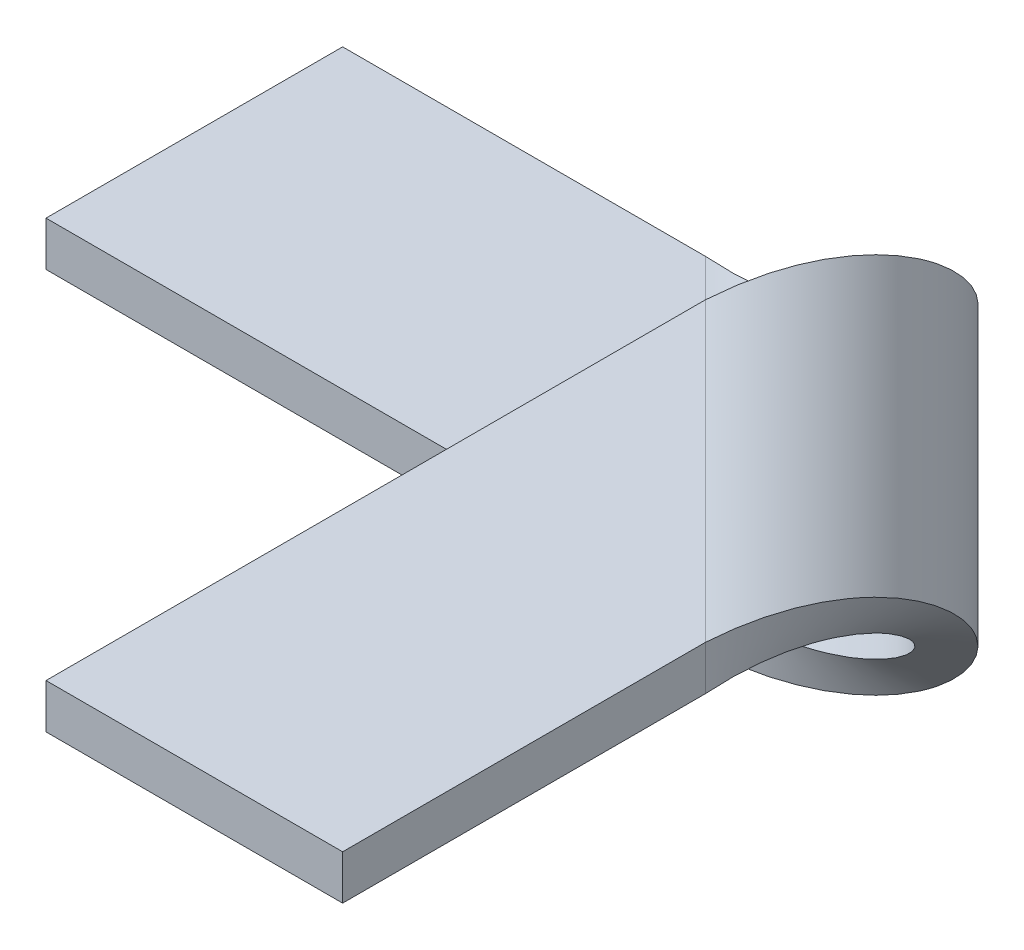
ISO-10303-21;
HEADER;
FILE_DESCRIPTION(('STEP AP214'),'2;1');
FILE_NAME('part.step','',(''),(''),'','','');
FILE_SCHEMA(('AUTOMOTIVE_DESIGN { 1 0 10303 214 1 1 1 1 }'));
ENDSEC;
DATA;
#1=APPLICATION_CONTEXT('core data for automotive mechanical design processes');
#2=APPLICATION_PROTOCOL_DEFINITION('international standard','automotive_design',2000,#1);
#3=PRODUCT_CONTEXT('',#1,'mechanical');
#4=PRODUCT('Part','Part','',(#3));
#5=PRODUCT_RELATED_PRODUCT_CATEGORY('part','',(#4));
#6=PRODUCT_DEFINITION_FORMATION('','',#4);
#7=PRODUCT_DEFINITION_CONTEXT('part definition',#1,'design');
#8=PRODUCT_DEFINITION('design','',#6,#7);
#9=PRODUCT_DEFINITION_SHAPE('','',#8);
#10=(LENGTH_UNIT() NAMED_UNIT(*) SI_UNIT(.MILLI.,.METRE.));
#11=(NAMED_UNIT(*) PLANE_ANGLE_UNIT() SI_UNIT($,.RADIAN.));
#12=(NAMED_UNIT(*) SI_UNIT($,.STERADIAN.) SOLID_ANGLE_UNIT());
#13=UNCERTAINTY_MEASURE_WITH_UNIT(LENGTH_MEASURE(1.E-05),#10,'distance_accuracy_value','');
#14=(GEOMETRIC_REPRESENTATION_CONTEXT(3) GLOBAL_UNCERTAINTY_ASSIGNED_CONTEXT((#13)) GLOBAL_UNIT_ASSIGNED_CONTEXT((#10,
#11,#12)) REPRESENTATION_CONTEXT('',''));
#15=CARTESIAN_POINT('',(0.,0.,0.));
#16=DIRECTION('',(0.,0.,1.));
#17=DIRECTION('',(1.,0.,0.));
#18=AXIS2_PLACEMENT_3D('',#15,#16,#17);
#19=CARTESIAN_POINT('',(-1.26770716227688E-13,46.0000000000003,1.12892928419874E-13));
#20=DIRECTION('',(0.,-1.,0.));
#21=DIRECTION('',(1.,0.,0.));
#22=AXIS2_PLACEMENT_3D('',#19,#20,#21);
#23=PLANE('',#22);
#24=DIRECTION('',(0.,0.,1.));
#25=VECTOR('',#24,1.);
#26=CARTESIAN_POINT('',(20.0000000000013,45.9999999999998,120.));
#27=LINE('',#26,#25);
#28=CARTESIAN_POINT('',(20.0000000000007,46.,71.0931537888217));
#29=VERTEX_POINT('',#28);
#30=CARTESIAN_POINT('',(20.0000000000013,45.9999999999998,120.));
#31=VERTEX_POINT('',#30);
#32=EDGE_CURVE('E221',#29,#31,#27,.T.);
#33=ORIENTED_EDGE('',*,*,#32,.F.);
#34=DIRECTION('',(-0.707106781186551,0.,-0.707106781186544));
#35=VECTOR('',#34,1.);
#36=CARTESIAN_POINT('',(-25.5465768944106,46.,25.5465768944109));
#37=LINE('',#36,#35);
#38=CARTESIAN_POINT('',(-19.9999999999997,46.,31.0931537888218));
#39=VERTEX_POINT('',#38);
#40=EDGE_CURVE('E154',#29,#39,#37,.T.);
#41=ORIENTED_EDGE('',*,*,#40,.T.);
#42=DIRECTION('',(0.,0.,-1.));
#43=VECTOR('',#42,1.);
#44=CARTESIAN_POINT('',(-19.9999999999987,45.9999999999996,120.));
#45=LINE('',#44,#43);
#46=CARTESIAN_POINT('',(-19.9999999999987,45.9999999999996,120.));
#47=VERTEX_POINT('',#46);
#48=EDGE_CURVE('E230',#47,#39,#45,.T.);
#49=ORIENTED_EDGE('',*,*,#48,.F.);
#50=DIRECTION('',(-1.,0.,0.));
#51=VECTOR('',#50,1.);
#52=CARTESIAN_POINT('',(20.0000000000013,45.9999999999998,120.));
#53=LINE('',#52,#51);
#54=EDGE_CURVE('E227',#31,#47,#53,.T.);
#55=ORIENTED_EDGE('',*,*,#54,.F.);
#56=EDGE_LOOP('',(#33,#41,#49,#55));
#57=FACE_BOUND('',#56,.T.);
#58=ADVANCED_FACE('F57',(#57),#23,.F.);
#59=CARTESIAN_POINT('',(-19.9999999999987,45.9999999999996,120.));
#60=DIRECTION('',(-1.,0.,0.));
#61=DIRECTION('',(0.,0.,-1.));
#62=AXIS2_PLACEMENT_3D('',#59,#60,#61);
#63=PLANE('',#62);
#64=CARTESIAN_POINT('',(-19.9999999999996,40.,31.0931537888218));
#65=CARTESIAN_POINT('',(-19.9999999999997,46.,31.0931537888218));
#66=B_SPLINE_CURVE_WITH_KNOTS('',1,(#64,#65),.UNSPECIFIED.,.F.,.F.,(2,2),(0.,1.),.UNSPECIFIED.);
#67=CARTESIAN_POINT('',(-19.9999999999997,40.,31.0931537888217));
#68=VERTEX_POINT('',#67);
#69=EDGE_CURVE('E12',#68,#39,#66,.T.);
#70=ORIENTED_EDGE('',*,*,#69,.F.);
#71=DIRECTION('',(0.,0.,-1.));
#72=VECTOR('',#71,1.);
#73=CARTESIAN_POINT('',(-19.9999999999987,39.9999999999996,120.));
#74=LINE('',#73,#72);
#75=CARTESIAN_POINT('',(-19.9999999999987,39.9999999999996,120.));
#76=VERTEX_POINT('',#75);
#77=EDGE_CURVE('E74',#76,#68,#74,.T.);
#78=ORIENTED_EDGE('',*,*,#77,.F.);
#79=DIRECTION('',(0.,-1.,0.));
#80=VECTOR('',#79,1.);
#81=CARTESIAN_POINT('',(-19.9999999999987,45.9999999999996,120.));
#82=LINE('',#81,#80);
#83=EDGE_CURVE('E490',#47,#76,#82,.T.);
#84=ORIENTED_EDGE('',*,*,#83,.F.);
#85=ORIENTED_EDGE('',*,*,#48,.T.);
#86=EDGE_LOOP('',(#70,#78,#84,#85));
#87=FACE_BOUND('',#86,.T.);
#88=ADVANCED_FACE('F59',(#87),#63,.T.);
#89=CARTESIAN_POINT('',(20.0000000000013,45.9999999999998,120.));
#90=DIRECTION('',(0.,0.,1.));
#91=DIRECTION('',(-1.,0.,0.));
#92=AXIS2_PLACEMENT_3D('',#89,#90,#91);
#93=PLANE('',#92);
#94=DIRECTION('',(-1.,0.,0.));
#95=VECTOR('',#94,1.);
#96=CARTESIAN_POINT('',(20.0000000000013,39.9999999999998,120.));
#97=LINE('',#96,#95);
#98=CARTESIAN_POINT('',(20.0000000000013,39.9999999999998,120.));
#99=VERTEX_POINT('',#98);
#100=EDGE_CURVE('E232',#99,#76,#97,.T.);
#101=ORIENTED_EDGE('',*,*,#100,.F.);
#102=DIRECTION('',(0.,-1.,0.));
#103=VECTOR('',#102,1.);
#104=CARTESIAN_POINT('',(20.0000000000013,45.9999999999998,120.));
#105=LINE('',#104,#103);
#106=EDGE_CURVE('E494',#31,#99,#105,.T.);
#107=ORIENTED_EDGE('',*,*,#106,.F.);
#108=ORIENTED_EDGE('',*,*,#54,.T.);
#109=ORIENTED_EDGE('',*,*,#83,.T.);
#110=EDGE_LOOP('',(#101,#107,#108,#109));
#111=FACE_BOUND('',#110,.T.);
#112=ADVANCED_FACE('F205',(#111),#93,.T.);
#113=CARTESIAN_POINT('',(20.0000000000013,45.9999999999998,120.));
#114=DIRECTION('',(1.,0.,0.));
#115=DIRECTION('',(0.,0.,1.));
#116=AXIS2_PLACEMENT_3D('',#113,#114,#115);
#117=PLANE('',#116);
#118=CARTESIAN_POINT('',(20.0000000000008,46.,71.0931537888218));
#119=CARTESIAN_POINT('',(20.0000000000009,40.,71.0931537888218));
#120=B_SPLINE_CURVE_WITH_KNOTS('',1,(#118,#119),.UNSPECIFIED.,.F.,.F.,(2,2),(0.,1.),.UNSPECIFIED.);
#121=CARTESIAN_POINT('',(20.0000000000007,40.,71.0931537888217));
#122=VERTEX_POINT('',#121);
#123=EDGE_CURVE('E314',#29,#122,#120,.T.);
#124=ORIENTED_EDGE('',*,*,#123,.F.);
#125=ORIENTED_EDGE('',*,*,#32,.T.);
#126=ORIENTED_EDGE('',*,*,#106,.T.);
#127=DIRECTION('',(0.,0.,1.));
#128=VECTOR('',#127,1.);
#129=CARTESIAN_POINT('',(20.0000000000013,39.9999999999998,120.));
#130=LINE('',#129,#128);
#131=EDGE_CURVE('E82',#122,#99,#130,.T.);
#132=ORIENTED_EDGE('',*,*,#131,.F.);
#133=EDGE_LOOP('',(#124,#125,#126,#132));
#134=FACE_BOUND('',#133,.T.);
#135=ADVANCED_FACE('F208',(#134),#117,.T.);
#136=CARTESIAN_POINT('',(0.,40.0000000000003,0.));
#137=DIRECTION('',(0.,-1.,0.));
#138=DIRECTION('',(1.,0.,0.));
#139=AXIS2_PLACEMENT_3D('',#136,#137,#138);
#140=PLANE('',#139);
#141=DIRECTION('',(-0.707106781186551,0.,-0.707106781186544));
#142=VECTOR('',#141,1.);
#143=CARTESIAN_POINT('',(-25.5465768944106,40.,25.5465768944109));
#144=LINE('',#143,#142);
#145=EDGE_CURVE('E67',#122,#68,#144,.T.);
#146=ORIENTED_EDGE('',*,*,#145,.F.);
#147=ORIENTED_EDGE('',*,*,#131,.T.);
#148=ORIENTED_EDGE('',*,*,#100,.T.);
#149=ORIENTED_EDGE('',*,*,#77,.T.);
#150=EDGE_LOOP('',(#146,#147,#148,#149));
#151=FACE_BOUND('',#150,.T.);
#152=ADVANCED_FACE('F215',(#151),#140,.T.);
#153=CARTESIAN_POINT('',(-120.,-6.,20.));
#154=DIRECTION('',(-1.,0.,0.));
#155=DIRECTION('',(0.,0.,1.));
#156=AXIS2_PLACEMENT_3D('',#153,#154,#155);
#157=PLANE('',#156);
#158=DIRECTION('',(0.,0.,1.));
#159=VECTOR('',#158,1.);
#160=CARTESIAN_POINT('',(-120.,0.,20.));
#161=LINE('',#160,#159);
#162=CARTESIAN_POINT('',(-120.,0.,-20.));
#163=VERTEX_POINT('',#162);
#164=CARTESIAN_POINT('',(-120.,0.,20.));
#165=VERTEX_POINT('',#164);
#166=EDGE_CURVE('E252',#163,#165,#161,.T.);
#167=ORIENTED_EDGE('',*,*,#166,.F.);
#168=DIRECTION('',(0.,1.,0.));
#169=VECTOR('',#168,1.);
#170=CARTESIAN_POINT('',(-120.,-6.,-20.));
#171=LINE('',#170,#169);
#172=CARTESIAN_POINT('',(-120.,-6.,-20.));
#173=VERTEX_POINT('',#172);
#174=EDGE_CURVE('E180',#173,#163,#171,.T.);
#175=ORIENTED_EDGE('',*,*,#174,.F.);
#176=DIRECTION('',(0.,0.,1.));
#177=VECTOR('',#176,1.);
#178=CARTESIAN_POINT('',(-120.,-6.,20.));
#179=LINE('',#178,#177);
#180=CARTESIAN_POINT('',(-120.,-6.,20.));
#181=VERTEX_POINT('',#180);
#182=EDGE_CURVE('E168',#173,#181,#179,.T.);
#183=ORIENTED_EDGE('',*,*,#182,.T.);
#184=DIRECTION('',(0.,1.,0.));
#185=VECTOR('',#184,1.);
#186=CARTESIAN_POINT('',(-120.,-6.,20.));
#187=LINE('',#186,#185);
#188=EDGE_CURVE('E171',#181,#165,#187,.T.);
#189=ORIENTED_EDGE('',*,*,#188,.T.);
#190=EDGE_LOOP('',(#167,#175,#183,#189));
#191=FACE_BOUND('',#190,.T.);
#192=ADVANCED_FACE('F277',(#191),#157,.T.);
#193=CARTESIAN_POINT('',(0.,-6.,0.));
#194=DIRECTION('',(0.,1.,0.));
#195=DIRECTION('',(0.,0.,1.));
#196=AXIS2_PLACEMENT_3D('',#193,#194,#195);
#197=PLANE('',#196);
#198=DIRECTION('',(-0.707106781186552,0.,-0.707106781186543));
#199=VECTOR('',#198,1.);
#200=CARTESIAN_POINT('',(-25.5465768944105,-6.,25.5465768944108));
#201=LINE('',#200,#199);
#202=CARTESIAN_POINT('',(-31.0931537888213,-6.00000000000001,20.0000000000001));
#203=VERTEX_POINT('',#202);
#204=CARTESIAN_POINT('',(-71.0931537888218,-6.,-20.));
#205=VERTEX_POINT('',#204);
#206=EDGE_CURVE('E151',#203,#205,#201,.T.);
#207=ORIENTED_EDGE('',*,*,#206,.F.);
#208=DIRECTION('',(1.,0.,0.));
#209=VECTOR('',#208,1.);
#210=CARTESIAN_POINT('',(120.,-6.,20.));
#211=LINE('',#210,#209);
#212=EDGE_CURVE('E143',#181,#203,#211,.T.);
#213=ORIENTED_EDGE('',*,*,#212,.F.);
#214=ORIENTED_EDGE('',*,*,#182,.F.);
#215=DIRECTION('',(-1.,0.,0.));
#216=VECTOR('',#215,1.);
#217=CARTESIAN_POINT('',(120.,-6.,-20.));
#218=LINE('',#217,#216);
#219=EDGE_CURVE('E166',#205,#173,#218,.T.);
#220=ORIENTED_EDGE('',*,*,#219,.F.);
#221=EDGE_LOOP('',(#207,#213,#214,#220));
#222=FACE_BOUND('',#221,.T.);
#223=ADVANCED_FACE('F163',(#222),#197,.F.);
#224=CARTESIAN_POINT('',(120.,-6.,20.));
#225=DIRECTION('',(0.,0.,1.));
#226=DIRECTION('',(1.,0.,0.));
#227=AXIS2_PLACEMENT_3D('',#224,#225,#226);
#228=PLANE('',#227);
#229=ORIENTED_EDGE('',*,*,#212,.T.);
#230=CARTESIAN_POINT('',(-31.0931537888213,0.,20.0000000000001));
#231=CARTESIAN_POINT('',(-31.0931537888213,-6.00000000000001,20.0000000000001));
#232=B_SPLINE_CURVE_WITH_KNOTS('',1,(#230,#231),.UNSPECIFIED.,.F.,.F.,(2,2),(0.,1.),.UNSPECIFIED.);
#233=CARTESIAN_POINT('',(-31.0931537888214,0.,20.));
#234=VERTEX_POINT('',#233);
#235=EDGE_CURVE('E126',#203,#234,#232,.F.);
#236=ORIENTED_EDGE('',*,*,#235,.T.);
#237=DIRECTION('',(1.,0.,0.));
#238=VECTOR('',#237,1.);
#239=CARTESIAN_POINT('',(120.,0.,20.));
#240=LINE('',#239,#238);
#241=EDGE_CURVE('E142',#165,#234,#240,.T.);
#242=ORIENTED_EDGE('',*,*,#241,.F.);
#243=ORIENTED_EDGE('',*,*,#188,.F.);
#244=EDGE_LOOP('',(#229,#236,#242,#243));
#245=FACE_BOUND('',#244,.T.);
#246=ADVANCED_FACE('F170',(#245),#228,.T.);
#247=CARTESIAN_POINT('',(0.,0.,0.));
#248=DIRECTION('',(0.,1.,0.));
#249=DIRECTION('',(0.,0.,1.));
#250=AXIS2_PLACEMENT_3D('',#247,#248,#249);
#251=PLANE('',#250);
#252=ORIENTED_EDGE('',*,*,#241,.T.);
#253=DIRECTION('',(-0.707106781186552,0.,-0.707106781186543));
#254=VECTOR('',#253,1.);
#255=CARTESIAN_POINT('',(-25.5465768944105,0.,25.5465768944108));
#256=LINE('',#255,#254);
#257=CARTESIAN_POINT('',(-71.0931537888218,0.,-19.9999999999999));
#258=VERTEX_POINT('',#257);
#259=EDGE_CURVE('E256',#234,#258,#256,.T.);
#260=ORIENTED_EDGE('',*,*,#259,.T.);
#261=DIRECTION('',(-1.,0.,0.));
#262=VECTOR('',#261,1.);
#263=CARTESIAN_POINT('',(120.,0.,-20.));
#264=LINE('',#263,#262);
#265=EDGE_CURVE('E191',#258,#163,#264,.T.);
#266=ORIENTED_EDGE('',*,*,#265,.T.);
#267=ORIENTED_EDGE('',*,*,#166,.T.);
#268=EDGE_LOOP('',(#252,#260,#266,#267));
#269=FACE_BOUND('',#268,.T.);
#270=ADVANCED_FACE('F203',(#269),#251,.T.);
#271=CARTESIAN_POINT('',(120.,-6.,-20.));
#272=DIRECTION('',(0.,0.,-1.));
#273=DIRECTION('',(-1.,0.,0.));
#274=AXIS2_PLACEMENT_3D('',#271,#272,#273);
#275=PLANE('',#274);
#276=ORIENTED_EDGE('',*,*,#265,.F.);
#277=CARTESIAN_POINT('',(-71.0931537888218,-6.00000000000001,-19.9999999999999));
#278=CARTESIAN_POINT('',(-71.0931537888218,0.,-19.9999999999999));
#279=B_SPLINE_CURVE_WITH_KNOTS('',1,(#277,#278),.UNSPECIFIED.,.F.,.F.,(2,2),(0.,1.),.UNSPECIFIED.);
#280=EDGE_CURVE('E181',#258,#205,#279,.F.);
#281=ORIENTED_EDGE('',*,*,#280,.T.);
#282=ORIENTED_EDGE('',*,*,#219,.T.);
#283=ORIENTED_EDGE('',*,*,#174,.T.);
#284=EDGE_LOOP('',(#276,#281,#282,#283));
#285=FACE_BOUND('',#284,.T.);
#286=ADVANCED_FACE('F193',(#285),#275,.T.);
#287=CARTESIAN_POINT('',(20.0000000000008,46.,71.0931537888218));
#288=CARTESIAN_POINT('',(20.2777082698823,46.,66.557252047424));
#289=CARTESIAN_POINT('',(20.5544134880493,45.3232895933763,62.023214669303));
#290=CARTESIAN_POINT('',(20.7433966685479,42.7184460972108,53.318705857334));
#291=CARTESIAN_POINT('',(20.6538969399684,40.7913379023528,49.1504427701784));
#292=CARTESIAN_POINT('',(19.7995261656221,35.9782147193479,41.4892879130543));
#293=CARTESIAN_POINT('',(19.0333160304188,33.0940934896435,37.9977352325224));
#294=CARTESIAN_POINT('',(16.6174557147519,26.8054449933414,31.8980699167189));
#295=CARTESIAN_POINT('',(14.9670808243075,23.403392041389,29.2906819914282));
#296=CARTESIAN_POINT('',(10.7093180085724,16.5966079586111,25.032919175693));
#297=CARTESIAN_POINT('',(8.1019300832816,13.1945550066588,23.3825442852486));
#298=CARTESIAN_POINT('',(2.00226476747813,6.90590651035668,20.9666839695818));
#299=CARTESIAN_POINT('',(-1.48928791305372,4.02178528065227,20.2004738343785));
#300=CARTESIAN_POINT('',(-9.15044277017782,-0.791337902352648,19.3461030600324));
#301=CARTESIAN_POINT('',(-13.3187058573335,-2.71844609721068,19.2566033314528));
#302=CARTESIAN_POINT('',(-22.0232146693025,-5.3232895933762,19.4455865119515));
#303=CARTESIAN_POINT('',(-26.5572520474235,-6.,19.7222917301186));
#304=CARTESIAN_POINT('',(-31.0931537888213,-6.00000000000001,20.0000000000001));
#305=CARTESIAN_POINT('',(20.0000000000009,40.,71.0931537888218));
#306=CARTESIAN_POINT('',(19.7222982598617,40.,67.1127621801614));
#307=CARTESIAN_POINT('',(19.4439112640993,39.4794535333663,63.1337168932531));
#308=CARTESIAN_POINT('',(18.6067222916208,37.4757277670852,55.4553802342611));
#309=CARTESIAN_POINT('',(18.0465960216672,35.9933368479637,51.7577436884797));
#310=CARTESIAN_POINT('',(16.4068270839235,32.2909343994984,44.881986994753));
#311=CARTESIAN_POINT('',(15.3261543473361,30.0723796074181,41.7048969156052));
#312=CARTESIAN_POINT('',(12.4852396085765,25.2349576871857,36.0302860228944));
#313=CARTESIAN_POINT('',(10.7244401371883,22.6179938779916,33.5333226785475));
#314=CARTESIAN_POINT('',(6.46667732145312,17.3820061220086,29.2755598628123));
#315=CARTESIAN_POINT('',(3.96971397710616,14.7650423128145,27.5147603914242));
#316=CARTESIAN_POINT('',(-1.70489691560463,9.92762039258205,24.6738456526646));
#317=CARTESIAN_POINT('',(-4.88198699475242,7.70906560050175,23.5931729160773));
#318=CARTESIAN_POINT('',(-11.7577436884791,4.00666315203642,21.9534039783337));
#319=CARTESIAN_POINT('',(-15.4553802342606,2.52427223291486,21.39327770838));
#320=CARTESIAN_POINT('',(-23.1337168932525,0.520546466633689,20.5560887359016));
#321=CARTESIAN_POINT('',(-27.1127621801609,0.,20.2777017401392));
#322=CARTESIAN_POINT('',(-31.0931537888213,0.,20.0000000000001));
#323=B_SPLINE_SURFACE_WITH_KNOTS('',1,3,((#287,#288,#289,#290,#291,#292,#293,#294,#295,#296,
#297,#298,#299,#300,#301,#302,#303,#304),(#305,#306,#307,#308,#309,#310,#311,#312,#313,#314,
#315,#316,#317,#318,#319,#320,#321,#322)),.UNSPECIFIED.,.F.,.F.,.F.,(2,2),(4,2,2,2,2,2,2,2,4),
(0.,1.),(0.,0.125,0.25,0.375,0.5,0.625,0.75,0.875,1.),.UNSPECIFIED.);
#324=CARTESIAN_POINT('',(20.0000000000009,40.,71.0931537888218));
#325=CARTESIAN_POINT('',(19.7222982598617,40.,67.1127621801614));
#326=CARTESIAN_POINT('',(19.4439112640993,39.4794535333663,63.1337168932531));
#327=CARTESIAN_POINT('',(18.6067222916208,37.4757277670852,55.4553802342611));
#328=CARTESIAN_POINT('',(18.0465960216672,35.9933368479637,51.7577436884797));
#329=CARTESIAN_POINT('',(16.4068270839235,32.2909343994984,44.881986994753));
#330=CARTESIAN_POINT('',(15.3261543473361,30.0723796074181,41.7048969156052));
#331=CARTESIAN_POINT('',(12.4852396085765,25.2349576871857,36.0302860228944));
#332=CARTESIAN_POINT('',(10.7244401371883,22.6179938779916,33.5333226785475));
#333=CARTESIAN_POINT('',(6.46667732145312,17.3820061220086,29.2755598628123));
#334=CARTESIAN_POINT('',(3.96971397710616,14.7650423128145,27.5147603914242));
#335=CARTESIAN_POINT('',(-1.70489691560463,9.92762039258205,24.6738456526646));
#336=CARTESIAN_POINT('',(-4.88198699475242,7.70906560050175,23.5931729160773));
#337=CARTESIAN_POINT('',(-11.7577436884791,4.00666315203642,21.9534039783337));
#338=CARTESIAN_POINT('',(-15.4553802342606,2.52427223291486,21.39327770838));
#339=CARTESIAN_POINT('',(-23.1337168932525,0.520546466633689,20.5560887359016));
#340=CARTESIAN_POINT('',(-27.1127621801609,0.,20.2777017401392));
#341=CARTESIAN_POINT('',(-31.0931537888213,0.,20.0000000000001));
#342=B_SPLINE_CURVE_WITH_KNOTS('',3,(#324,#325,#326,#327,#328,#329,#330,#331,#332,#333,#334,
#335,#336,#337,#338,#339,#340,#341),.UNSPECIFIED.,.F.,.F.,(4,2,2,2,2,2,2,2,4),(0.,0.125,0.25,
0.375,0.5,0.625,0.75,0.875,1.),.UNSPECIFIED.);
#343=EDGE_CURVE('E135',#122,#234,#342,.T.);
#344=CARTESIAN_POINT('',(-31.0931537888213,-6.00000000000001,20.0000000000001));
#345=CARTESIAN_POINT('',(-26.5572520474235,-6.,19.7222917301186));
#346=CARTESIAN_POINT('',(-22.0232146693025,-5.3232895933762,19.4455865119515));
#347=CARTESIAN_POINT('',(-13.3187058573335,-2.71844609721068,19.2566033314528));
#348=CARTESIAN_POINT('',(-9.15044277017782,-0.791337902352648,19.3461030600324));
#349=CARTESIAN_POINT('',(-1.48928791305372,4.02178528065227,20.2004738343785));
#350=CARTESIAN_POINT('',(2.00226476747813,6.90590651035668,20.9666839695818));
#351=CARTESIAN_POINT('',(8.1019300832816,13.1945550066588,23.3825442852486));
#352=CARTESIAN_POINT('',(10.7093180085724,16.5966079586111,25.032919175693));
#353=CARTESIAN_POINT('',(14.9670808243075,23.403392041389,29.2906819914282));
#354=CARTESIAN_POINT('',(16.6174557147519,26.8054449933414,31.8980699167189));
#355=CARTESIAN_POINT('',(19.0333160304188,33.0940934896435,37.9977352325224));
#356=CARTESIAN_POINT('',(19.7995261656221,35.9782147193479,41.4892879130543));
#357=CARTESIAN_POINT('',(20.6538969399684,40.7913379023528,49.1504427701784));
#358=CARTESIAN_POINT('',(20.7433966685479,42.7184460972108,53.318705857334));
#359=CARTESIAN_POINT('',(20.5544134880493,45.3232895933763,62.023214669303));
#360=CARTESIAN_POINT('',(20.2777082698823,46.,66.557252047424));
#361=CARTESIAN_POINT('',(20.0000000000008,46.,71.0931537888218));
#362=B_SPLINE_CURVE_WITH_KNOTS('',3,(#344,#345,#346,#347,#348,#349,#350,#351,#352,#353,#354,
#355,#356,#357,#358,#359,#360,#361),.UNSPECIFIED.,.F.,.F.,(4,2,2,2,2,2,2,2,4),(0.,0.125,0.25,
0.375,0.5,0.625,0.75,0.875,1.),.UNSPECIFIED.);
#363=EDGE_CURVE('E131',#29,#203,#362,.F.);
#364=ORIENTED_EDGE('',*,*,#123,.T.);
#365=ORIENTED_EDGE('',*,*,#343,.T.);
#366=ORIENTED_EDGE('',*,*,#235,.F.);
#367=ORIENTED_EDGE('',*,*,#363,.F.);
#368=EDGE_LOOP('',(#364,#365,#366,#367));
#369=FACE_BOUND('',#368,.T.);
#370=ADVANCED_FACE('F130',(#369),#323,.T.);
#371=CARTESIAN_POINT('',(-71.0931537888218,-6.00000000000001,-19.9999999999999));
#372=CARTESIAN_POINT('',(-66.5572520474239,-6.,-20.2777082698814));
#373=CARTESIAN_POINT('',(-62.0232146693029,-5.3232895933762,-20.5544134880485));
#374=CARTESIAN_POINT('',(-53.318705857334,-2.71844609721068,-20.7433966685472));
#375=CARTESIAN_POINT('',(-49.1504427701783,-0.791337902352648,-20.6538969399677));
#376=CARTESIAN_POINT('',(-41.4892879130542,4.02178528065227,-19.7995261656215));
#377=CARTESIAN_POINT('',(-37.9977352325224,6.90590651035668,-19.0333160304182));
#378=CARTESIAN_POINT('',(-31.8980699167189,13.1945550066588,-16.6174557147514));
#379=CARTESIAN_POINT('',(-29.2906819914281,16.5966079586111,-14.967080824307));
#380=CARTESIAN_POINT('',(-25.032919175693,23.403392041389,-10.7093180085719));
#381=CARTESIAN_POINT('',(-23.3825442852486,26.8054449933414,-8.10193008328109));
#382=CARTESIAN_POINT('',(-20.9666839695817,33.0940934896435,-2.00226476747762));
#383=CARTESIAN_POINT('',(-20.2004738343784,35.9782147193479,1.48928791305422));
#384=CARTESIAN_POINT('',(-19.3461030600321,40.7913379023528,9.15044277017833));
#385=CARTESIAN_POINT('',(-19.2566033314526,42.7184460972108,13.318705857334));
#386=CARTESIAN_POINT('',(-19.4455865119512,45.3232895933762,22.023214669303));
#387=CARTESIAN_POINT('',(-19.7222917301182,46.,26.557252047424));
#388=CARTESIAN_POINT('',(-19.9999999999997,46.,31.0931537888218));
#389=CARTESIAN_POINT('',(-71.0931537888218,0.,-19.9999999999999));
#390=CARTESIAN_POINT('',(-67.1127621801613,0.,-19.7222982598608));
#391=CARTESIAN_POINT('',(-63.133716893253,0.520546466633694,-19.4439112640984));
#392=CARTESIAN_POINT('',(-55.4553802342611,2.52427223291486,-18.60672229162));
#393=CARTESIAN_POINT('',(-51.7577436884796,4.00666315203642,-18.0465960216664));
#394=CARTESIAN_POINT('',(-44.8819869947529,7.70906560050175,-16.4068270839227));
#395=CARTESIAN_POINT('',(-41.7048969156051,9.92762039258206,-15.3261543473354));
#396=CARTESIAN_POINT('',(-36.0302860228944,14.7650423128145,-12.4852396085759));
#397=CARTESIAN_POINT('',(-33.5333226785474,17.3820061220086,-10.7244401371877));
#398=CARTESIAN_POINT('',(-29.2755598628122,22.6179938779916,-6.46667732145254));
#399=CARTESIAN_POINT('',(-27.514760391424,25.2349576871857,-3.96971397710559));
#400=CARTESIAN_POINT('',(-24.6738456526644,30.0723796074181,1.70489691560519));
#401=CARTESIAN_POINT('',(-23.5931729160771,32.2909343994984,4.88198699475296));
#402=CARTESIAN_POINT('',(-21.9534039783334,35.9933368479637,11.7577436884796));
#403=CARTESIAN_POINT('',(-21.3932777083797,37.4757277670852,15.4553802342611));
#404=CARTESIAN_POINT('',(-20.5560887359012,39.4794535333663,23.133716893253));
#405=CARTESIAN_POINT('',(-20.2777017401388,40.,27.1127621801614));
#406=CARTESIAN_POINT('',(-19.9999999999996,40.,31.0931537888218));
#407=B_SPLINE_SURFACE_WITH_KNOTS('',1,3,((#371,#372,#373,#374,#375,#376,#377,#378,#379,#380,
#381,#382,#383,#384,#385,#386,#387,#388),(#389,#390,#391,#392,#393,#394,#395,#396,#397,#398,
#399,#400,#401,#402,#403,#404,#405,#406)),.UNSPECIFIED.,.F.,.F.,.F.,(2,2),(4,2,2,2,2,2,2,2,4),
(0.,1.),(0.,0.125,0.25,0.375,0.5,0.625,0.75,0.875,1.),.UNSPECIFIED.);
#408=CARTESIAN_POINT('',(-71.0931537888218,0.,-19.9999999999999));
#409=CARTESIAN_POINT('',(-67.1127621801613,0.,-19.7222982598608));
#410=CARTESIAN_POINT('',(-63.133716893253,0.520546466633694,-19.4439112640984));
#411=CARTESIAN_POINT('',(-55.4553802342611,2.52427223291486,-18.60672229162));
#412=CARTESIAN_POINT('',(-51.7577436884796,4.00666315203642,-18.0465960216664));
#413=CARTESIAN_POINT('',(-44.8819869947529,7.70906560050175,-16.4068270839227));
#414=CARTESIAN_POINT('',(-41.7048969156051,9.92762039258206,-15.3261543473354));
#415=CARTESIAN_POINT('',(-36.0302860228944,14.7650423128145,-12.4852396085759));
#416=CARTESIAN_POINT('',(-33.5333226785474,17.3820061220086,-10.7244401371877));
#417=CARTESIAN_POINT('',(-29.2755598628122,22.6179938779916,-6.46667732145254));
#418=CARTESIAN_POINT('',(-27.514760391424,25.2349576871857,-3.96971397710559));
#419=CARTESIAN_POINT('',(-24.6738456526644,30.0723796074181,1.70489691560519));
#420=CARTESIAN_POINT('',(-23.5931729160771,32.2909343994984,4.88198699475296));
#421=CARTESIAN_POINT('',(-21.9534039783334,35.9933368479637,11.7577436884796));
#422=CARTESIAN_POINT('',(-21.3932777083797,37.4757277670852,15.4553802342611));
#423=CARTESIAN_POINT('',(-20.5560887359012,39.4794535333663,23.133716893253));
#424=CARTESIAN_POINT('',(-20.2777017401388,40.,27.1127621801614));
#425=CARTESIAN_POINT('',(-19.9999999999996,40.,31.0931537888218));
#426=B_SPLINE_CURVE_WITH_KNOTS('',3,(#408,#409,#410,#411,#412,#413,#414,#415,#416,#417,#418,
#419,#420,#421,#422,#423,#424,#425),.UNSPECIFIED.,.F.,.F.,(4,2,2,2,2,2,2,2,4),(0.,0.125,0.25,
0.375,0.5,0.625,0.75,0.875,1.),.UNSPECIFIED.);
#427=EDGE_CURVE('E157',#258,#68,#426,.T.);
#428=CARTESIAN_POINT('',(-19.9999999999997,46.,31.0931537888218));
#429=CARTESIAN_POINT('',(-19.7222917301182,46.,26.557252047424));
#430=CARTESIAN_POINT('',(-19.4455865119512,45.3232895933762,22.023214669303));
#431=CARTESIAN_POINT('',(-19.2566033314526,42.7184460972108,13.318705857334));
#432=CARTESIAN_POINT('',(-19.3461030600321,40.7913379023528,9.15044277017833));
#433=CARTESIAN_POINT('',(-20.2004738343784,35.9782147193479,1.48928791305422));
#434=CARTESIAN_POINT('',(-20.9666839695817,33.0940934896435,-2.00226476747762));
#435=CARTESIAN_POINT('',(-23.3825442852486,26.8054449933414,-8.10193008328109));
#436=CARTESIAN_POINT('',(-25.032919175693,23.403392041389,-10.7093180085719));
#437=CARTESIAN_POINT('',(-29.2906819914281,16.5966079586111,-14.967080824307));
#438=CARTESIAN_POINT('',(-31.8980699167189,13.1945550066588,-16.6174557147514));
#439=CARTESIAN_POINT('',(-37.9977352325224,6.90590651035668,-19.0333160304182));
#440=CARTESIAN_POINT('',(-41.4892879130542,4.02178528065227,-19.7995261656215));
#441=CARTESIAN_POINT('',(-49.1504427701783,-0.791337902352648,-20.6538969399677));
#442=CARTESIAN_POINT('',(-53.318705857334,-2.71844609721068,-20.7433966685472));
#443=CARTESIAN_POINT('',(-62.0232146693029,-5.3232895933762,-20.5544134880485));
#444=CARTESIAN_POINT('',(-66.5572520474239,-6.,-20.2777082698814));
#445=CARTESIAN_POINT('',(-71.0931537888218,-6.00000000000001,-19.9999999999999));
#446=B_SPLINE_CURVE_WITH_KNOTS('',3,(#428,#429,#430,#431,#432,#433,#434,#435,#436,#437,#438,
#439,#440,#441,#442,#443,#444,#445),.UNSPECIFIED.,.F.,.F.,(4,2,2,2,2,2,2,2,4),(0.,0.125,0.25,
0.375,0.5,0.625,0.75,0.875,1.),.UNSPECIFIED.);
#447=EDGE_CURVE('E156',#205,#39,#446,.F.);
#448=ORIENTED_EDGE('',*,*,#280,.F.);
#449=ORIENTED_EDGE('',*,*,#427,.T.);
#450=ORIENTED_EDGE('',*,*,#69,.T.);
#451=ORIENTED_EDGE('',*,*,#447,.F.);
#452=EDGE_LOOP('',(#448,#449,#450,#451));
#453=FACE_BOUND('',#452,.T.);
#454=ADVANCED_FACE('F285',(#453),#407,.T.);
#455=CARTESIAN_POINT('',(-155.622924817377,20.,-104.529771028554));
#456=DIRECTION('',(0.707106781186552,0.,0.707106781186543));
#457=DIRECTION('',(0.707106781186543,0.,-0.707106781186552));
#458=AXIS2_PLACEMENT_3D('',#455,#456,#457);
#459=CYLINDRICAL_SURFACE('',#458,26.);
#460=ORIENTED_EDGE('',*,*,#447,.T.);
#461=ORIENTED_EDGE('',*,*,#40,.F.);
#462=ORIENTED_EDGE('',*,*,#363,.T.);
#463=ORIENTED_EDGE('',*,*,#206,.T.);
#464=EDGE_LOOP('',(#460,#461,#462,#463));
#465=FACE_BOUND('',#464,.T.);
#466=ADVANCED_FACE('F150',(#465),#459,.T.);
#467=CARTESIAN_POINT('',(-155.622924817377,20.,-104.529771028554));
#468=DIRECTION('',(0.707106781186552,0.,0.707106781186543));
#469=DIRECTION('',(0.707106781186543,0.,-0.707106781186552));
#470=AXIS2_PLACEMENT_3D('',#467,#468,#469);
#471=CYLINDRICAL_SURFACE('',#470,20.);
#472=ORIENTED_EDGE('',*,*,#427,.F.);
#473=ORIENTED_EDGE('',*,*,#259,.F.);
#474=ORIENTED_EDGE('',*,*,#343,.F.);
#475=ORIENTED_EDGE('',*,*,#145,.T.);
#476=EDGE_LOOP('',(#472,#473,#474,#475));
#477=FACE_BOUND('',#476,.T.);
#478=ADVANCED_FACE('F342',(#477),#471,.F.);
#479=CLOSED_SHELL('',(#58,#88,#112,#135,#152,#192,#223,#246,#270,#286,#370,#454,#466,#478));
#480=MANIFOLD_SOLID_BREP('B2',#479);
#481=ADVANCED_BREP_SHAPE_REPRESENTATION('',(#18,#480),#14);
#482=SHAPE_DEFINITION_REPRESENTATION(#9,#481);
ENDSEC;
END-ISO-10303-21;
